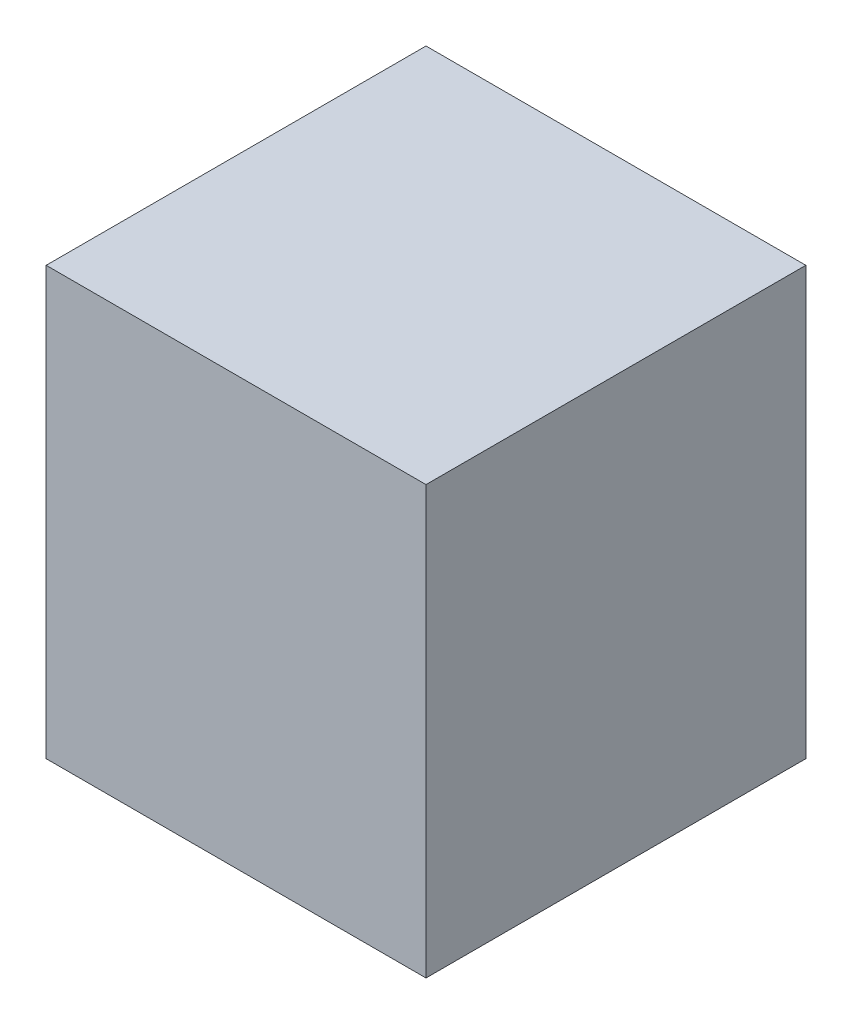
ISO-10303-21;
HEADER;
FILE_DESCRIPTION(('STEP AP214'),'2;1');
FILE_NAME('part.step','',(''),(''),'','','');
FILE_SCHEMA(('AUTOMOTIVE_DESIGN { 1 0 10303 214 1 1 1 1 }'));
ENDSEC;
DATA;
#1=APPLICATION_CONTEXT('core data for automotive mechanical design processes');
#2=APPLICATION_PROTOCOL_DEFINITION('international standard','automotive_design',2000,#1);
#3=PRODUCT_CONTEXT('',#1,'mechanical');
#4=PRODUCT('Part','Part','',(#3));
#5=PRODUCT_RELATED_PRODUCT_CATEGORY('part','',(#4));
#6=PRODUCT_DEFINITION_FORMATION('','',#4);
#7=PRODUCT_DEFINITION_CONTEXT('part definition',#1,'design');
#8=PRODUCT_DEFINITION('design','',#6,#7);
#9=PRODUCT_DEFINITION_SHAPE('','',#8);
#10=(LENGTH_UNIT() NAMED_UNIT(*) SI_UNIT(.MILLI.,.METRE.));
#11=(NAMED_UNIT(*) PLANE_ANGLE_UNIT() SI_UNIT($,.RADIAN.));
#12=(NAMED_UNIT(*) SI_UNIT($,.STERADIAN.) SOLID_ANGLE_UNIT());
#13=UNCERTAINTY_MEASURE_WITH_UNIT(LENGTH_MEASURE(1.E-05),#10,'distance_accuracy_value','');
#14=(GEOMETRIC_REPRESENTATION_CONTEXT(3) GLOBAL_UNCERTAINTY_ASSIGNED_CONTEXT((#13)) GLOBAL_UNIT_ASSIGNED_CONTEXT((#10,
#11,#12)) REPRESENTATION_CONTEXT('',''));
#15=CARTESIAN_POINT('',(0.,0.,0.));
#16=DIRECTION('',(0.,0.,1.));
#17=DIRECTION('',(1.,0.,0.));
#18=AXIS2_PLACEMENT_3D('',#15,#16,#17);
#19=CARTESIAN_POINT('',(0.40000174,0.45000164,0.80000094));
#20=DIRECTION('',(0.,0.,-1.));
#21=DIRECTION('',(-1.,0.,0.));
#22=AXIS2_PLACEMENT_3D('',#19,#20,#21);
#23=PLANE('',#22);
#24=DIRECTION('',(0.,1.,0.));
#25=VECTOR('',#24,1.);
#26=CARTESIAN_POINT('',(-0.3999992,0.45000164,0.80000094));
#27=LINE('',#26,#25);
#28=CARTESIAN_POINT('',(-0.3999992,0.45000164,0.80000094));
#29=VERTEX_POINT('',#28);
#30=CARTESIAN_POINT('',(-0.3999992,-0.4499991,0.80000094));
#31=VERTEX_POINT('',#30);
#32=EDGE_CURVE('E55',#29,#31,#27,.F.);
#33=ORIENTED_EDGE('',*,*,#32,.T.);
#34=DIRECTION('',(1.,0.,0.));
#35=VECTOR('',#34,1.);
#36=CARTESIAN_POINT('',(-0.3999992,-0.4499991,0.80000094));
#37=LINE('',#36,#35);
#38=CARTESIAN_POINT('',(0.40000174,-0.4499991,0.80000094));
#39=VERTEX_POINT('',#38);
#40=EDGE_CURVE('E57',#31,#39,#37,.T.);
#41=ORIENTED_EDGE('',*,*,#40,.T.);
#42=DIRECTION('',(0.,1.,0.));
#43=VECTOR('',#42,1.);
#44=CARTESIAN_POINT('',(0.40000174,-0.4499991,0.80000094));
#45=LINE('',#44,#43);
#46=CARTESIAN_POINT('',(0.40000174,0.45000164,0.80000094));
#47=VERTEX_POINT('',#46);
#48=EDGE_CURVE('E20',#39,#47,#45,.T.);
#49=ORIENTED_EDGE('',*,*,#48,.T.);
#50=DIRECTION('',(1.,0.,0.));
#51=VECTOR('',#50,1.);
#52=CARTESIAN_POINT('',(0.40000174,0.45000164,0.80000094));
#53=LINE('',#52,#51);
#54=EDGE_CURVE('E80',#47,#29,#53,.F.);
#55=ORIENTED_EDGE('',*,*,#54,.T.);
#56=EDGE_LOOP('',(#33,#41,#49,#55));
#57=FACE_BOUND('',#56,.T.);
#58=ADVANCED_FACE('F17',(#57),#23,.F.);
#59=CARTESIAN_POINT('',(0.40000174,-0.4499991,0.));
#60=DIRECTION('',(-1.,0.,0.));
#61=DIRECTION('',(0.,0.,1.));
#62=AXIS2_PLACEMENT_3D('',#59,#60,#61);
#63=PLANE('',#62);
#64=DIRECTION('',(0.,0.,-1.));
#65=VECTOR('',#64,1.);
#66=CARTESIAN_POINT('',(0.40000174,0.45000164,0.));
#67=LINE('',#66,#65);
#68=CARTESIAN_POINT('',(0.40000174,0.45000164,0.));
#69=VERTEX_POINT('',#68);
#70=EDGE_CURVE('E68',#69,#47,#67,.F.);
#71=ORIENTED_EDGE('',*,*,#70,.T.);
#72=ORIENTED_EDGE('',*,*,#48,.F.);
#73=DIRECTION('',(0.,0.,1.));
#74=VECTOR('',#73,1.);
#75=CARTESIAN_POINT('',(0.40000174,-0.4499991,0.));
#76=LINE('',#75,#74);
#77=CARTESIAN_POINT('',(0.40000174,-0.4499991,0.));
#78=VERTEX_POINT('',#77);
#79=EDGE_CURVE('E63',#39,#78,#76,.F.);
#80=ORIENTED_EDGE('',*,*,#79,.T.);
#81=DIRECTION('',(0.,1.,0.));
#82=VECTOR('',#81,1.);
#83=CARTESIAN_POINT('',(0.40000174,0.45000164,0.));
#84=LINE('',#83,#82);
#85=EDGE_CURVE('E83',#69,#78,#84,.F.);
#86=ORIENTED_EDGE('',*,*,#85,.F.);
#87=EDGE_LOOP('',(#71,#72,#80,#86));
#88=FACE_BOUND('',#87,.T.);
#89=ADVANCED_FACE('F65',(#88),#63,.F.);
#90=CARTESIAN_POINT('',(-0.3999992,-0.4499991,0.));
#91=DIRECTION('',(0.,1.,0.));
#92=DIRECTION('',(0.,0.,1.));
#93=AXIS2_PLACEMENT_3D('',#90,#91,#92);
#94=PLANE('',#93);
#95=ORIENTED_EDGE('',*,*,#79,.F.);
#96=ORIENTED_EDGE('',*,*,#40,.F.);
#97=DIRECTION('',(0.,0.,-1.));
#98=VECTOR('',#97,1.);
#99=CARTESIAN_POINT('',(-0.3999992,-0.4499991,0.));
#100=LINE('',#99,#98);
#101=CARTESIAN_POINT('',(-0.3999992,-0.4499991,0.));
#102=VERTEX_POINT('',#101);
#103=EDGE_CURVE('E75',#31,#102,#100,.T.);
#104=ORIENTED_EDGE('',*,*,#103,.T.);
#105=DIRECTION('',(-1.,0.,0.));
#106=VECTOR('',#105,1.);
#107=CARTESIAN_POINT('',(0.40000174,-0.4499991,0.));
#108=LINE('',#107,#106);
#109=EDGE_CURVE('E72',#78,#102,#108,.T.);
#110=ORIENTED_EDGE('',*,*,#109,.F.);
#111=EDGE_LOOP('',(#95,#96,#104,#110));
#112=FACE_BOUND('',#111,.T.);
#113=ADVANCED_FACE('F70',(#112),#94,.F.);
#114=CARTESIAN_POINT('',(-0.3999992,0.45000164,0.));
#115=DIRECTION('',(1.,0.,0.));
#116=DIRECTION('',(0.,0.,-1.));
#117=AXIS2_PLACEMENT_3D('',#114,#115,#116);
#118=PLANE('',#117);
#119=ORIENTED_EDGE('',*,*,#103,.F.);
#120=ORIENTED_EDGE('',*,*,#32,.F.);
#121=DIRECTION('',(0.,0.,-1.));
#122=VECTOR('',#121,1.);
#123=CARTESIAN_POINT('',(-0.3999992,0.45000164,0.));
#124=LINE('',#123,#122);
#125=CARTESIAN_POINT('',(-0.3999992,0.45000164,0.));
#126=VERTEX_POINT('',#125);
#127=EDGE_CURVE('E35',#29,#126,#124,.T.);
#128=ORIENTED_EDGE('',*,*,#127,.T.);
#129=DIRECTION('',(0.,1.,0.));
#130=VECTOR('',#129,1.);
#131=CARTESIAN_POINT('',(-0.3999992,0.45000164,0.));
#132=LINE('',#131,#130);
#133=EDGE_CURVE('E26',#102,#126,#132,.T.);
#134=ORIENTED_EDGE('',*,*,#133,.F.);
#135=EDGE_LOOP('',(#119,#120,#128,#134));
#136=FACE_BOUND('',#135,.T.);
#137=ADVANCED_FACE('F89',(#136),#118,.F.);
#138=CARTESIAN_POINT('',(0.40000174,0.45000164,0.));
#139=DIRECTION('',(0.,-1.,0.));
#140=DIRECTION('',(0.,0.,-1.));
#141=AXIS2_PLACEMENT_3D('',#138,#139,#140);
#142=PLANE('',#141);
#143=ORIENTED_EDGE('',*,*,#127,.F.);
#144=ORIENTED_EDGE('',*,*,#54,.F.);
#145=ORIENTED_EDGE('',*,*,#70,.F.);
#146=DIRECTION('',(-1.,0.,0.));
#147=VECTOR('',#146,1.);
#148=CARTESIAN_POINT('',(0.40000174,0.45000164,0.));
#149=LINE('',#148,#147);
#150=EDGE_CURVE('E11',#126,#69,#149,.F.);
#151=ORIENTED_EDGE('',*,*,#150,.F.);
#152=EDGE_LOOP('',(#143,#144,#145,#151));
#153=FACE_BOUND('',#152,.T.);
#154=ADVANCED_FACE('F91',(#153),#142,.F.);
#155=CARTESIAN_POINT('',(0.40000174,0.45000164,0.));
#156=DIRECTION('',(0.,0.,-1.));
#157=DIRECTION('',(-1.,0.,0.));
#158=AXIS2_PLACEMENT_3D('',#155,#156,#157);
#159=PLANE('',#158);
#160=ORIENTED_EDGE('',*,*,#133,.T.);
#161=ORIENTED_EDGE('',*,*,#150,.T.);
#162=ORIENTED_EDGE('',*,*,#85,.T.);
#163=ORIENTED_EDGE('',*,*,#109,.T.);
#164=EDGE_LOOP('',(#160,#161,#162,#163));
#165=FACE_BOUND('',#164,.T.);
#166=ADVANCED_FACE('F88',(#165),#159,.T.);
#167=CLOSED_SHELL('',(#58,#89,#113,#137,#154,#166));
#168=MANIFOLD_SOLID_BREP('B1',#167);
#169=ADVANCED_BREP_SHAPE_REPRESENTATION('',(#18,#168),#14);
#170=SHAPE_DEFINITION_REPRESENTATION(#9,#169);
ENDSEC;
END-ISO-10303-21;
